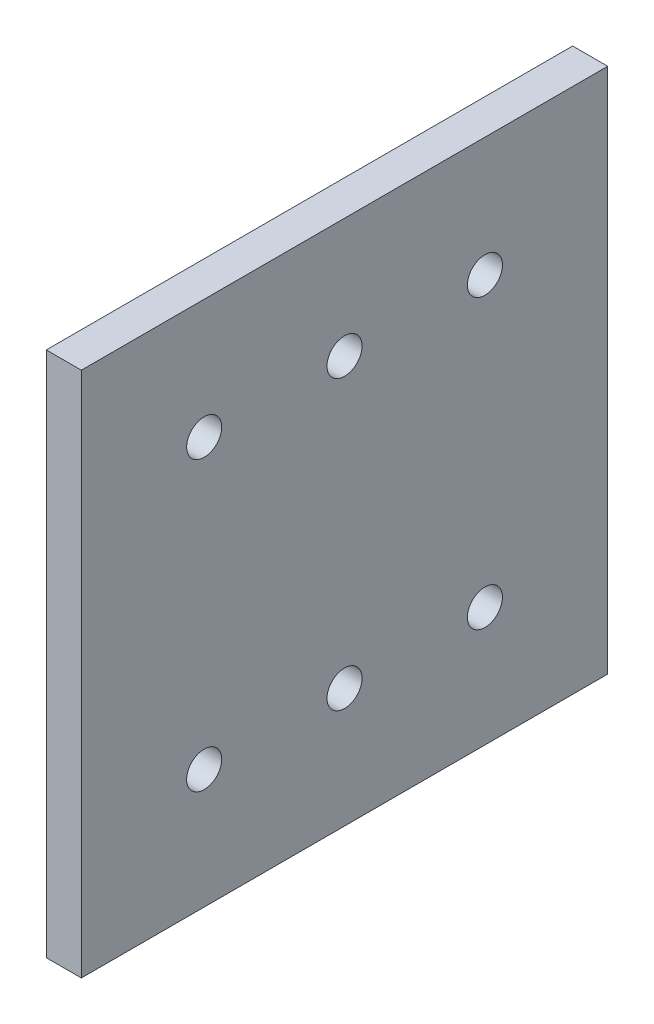
ISO-10303-21;
HEADER;
FILE_DESCRIPTION(('STEP AP214'),'2;1');
FILE_NAME('part.step','',(''),(''),'','','');
FILE_SCHEMA(('AUTOMOTIVE_DESIGN { 1 0 10303 214 1 1 1 1 }'));
ENDSEC;
DATA;
#1=APPLICATION_CONTEXT('core data for automotive mechanical design processes');
#2=APPLICATION_PROTOCOL_DEFINITION('international standard','automotive_design',2000,#1);
#3=PRODUCT_CONTEXT('',#1,'mechanical');
#4=PRODUCT('Part','Part','',(#3));
#5=PRODUCT_RELATED_PRODUCT_CATEGORY('part','',(#4));
#6=PRODUCT_DEFINITION_FORMATION('','',#4);
#7=PRODUCT_DEFINITION_CONTEXT('part definition',#1,'design');
#8=PRODUCT_DEFINITION('design','',#6,#7);
#9=PRODUCT_DEFINITION_SHAPE('','',#8);
#10=(LENGTH_UNIT() NAMED_UNIT(*) SI_UNIT(.MILLI.,.METRE.));
#11=(NAMED_UNIT(*) PLANE_ANGLE_UNIT() SI_UNIT($,.RADIAN.));
#12=(NAMED_UNIT(*) SI_UNIT($,.STERADIAN.) SOLID_ANGLE_UNIT());
#13=UNCERTAINTY_MEASURE_WITH_UNIT(LENGTH_MEASURE(1.E-05),#10,'distance_accuracy_value','');
#14=(GEOMETRIC_REPRESENTATION_CONTEXT(3) GLOBAL_UNCERTAINTY_ASSIGNED_CONTEXT((#13)) GLOBAL_UNIT_ASSIGNED_CONTEXT((#10,
#11,#12)) REPRESENTATION_CONTEXT('',''));
#15=CARTESIAN_POINT('',(0.,0.,0.));
#16=DIRECTION('',(0.,0.,1.));
#17=DIRECTION('',(1.,0.,0.));
#18=AXIS2_PLACEMENT_3D('',#15,#16,#17);
#19=CARTESIAN_POINT('',(418.,0.,0.));
#20=DIRECTION('',(-1.,0.,0.));
#21=DIRECTION('',(0.,0.,1.));
#22=AXIS2_PLACEMENT_3D('',#19,#20,#21);
#23=PLANE('',#22);
#24=DIRECTION('',(0.,-1.,0.));
#25=VECTOR('',#24,1.);
#26=CARTESIAN_POINT('',(418.,-20.5000000000011,1917.5));
#27=LINE('',#26,#25);
#28=CARTESIAN_POINT('',(418.,37.4999999999988,1917.5));
#29=VERTEX_POINT('',#28);
#30=CARTESIAN_POINT('',(418.,-37.500000000001,1917.5));
#31=VERTEX_POINT('',#30);
#32=EDGE_CURVE('E78',#29,#31,#27,.T.);
#33=ORIENTED_EDGE('',*,*,#32,.T.);
#34=DIRECTION('',(0.,0.,1.));
#35=VECTOR('',#34,1.);
#36=CARTESIAN_POINT('',(418.,-37.500000000001,1860.));
#37=LINE('',#36,#35);
#38=CARTESIAN_POINT('',(418.,-37.500000000001,1842.5));
#39=VERTEX_POINT('',#38);
#40=EDGE_CURVE('E85',#39,#31,#37,.T.);
#41=ORIENTED_EDGE('',*,*,#40,.F.);
#42=DIRECTION('',(0.,-1.,0.));
#43=VECTOR('',#42,1.);
#44=CARTESIAN_POINT('',(418.,-20.5000000000011,1842.5));
#45=LINE('',#44,#43);
#46=CARTESIAN_POINT('',(418.,37.4999999999988,1842.5));
#47=VERTEX_POINT('',#46);
#48=EDGE_CURVE('E93',#47,#39,#45,.T.);
#49=ORIENTED_EDGE('',*,*,#48,.F.);
#50=DIRECTION('',(0.,0.,1.));
#51=VECTOR('',#50,1.);
#52=CARTESIAN_POINT('',(418.,37.4999999999988,1860.));
#53=LINE('',#52,#51);
#54=EDGE_CURVE('E55',#47,#29,#53,.T.);
#55=ORIENTED_EDGE('',*,*,#54,.T.);
#56=EDGE_LOOP('',(#33,#41,#49,#55));
#57=FACE_BOUND('',#56,.T.);
#58=CARTESIAN_POINT('',(418.,-20.5000000000011,1900.));
#59=DIRECTION('',(1.,0.,0.));
#60=DIRECTION('',(0.,0.,-1.));
#61=AXIS2_PLACEMENT_3D('',#58,#59,#60);
#62=CIRCLE('',#61,2.49999999999999);
#63=CARTESIAN_POINT('',(418.,-20.5000000000011,1897.5));
#64=VERTEX_POINT('',#63);
#65=EDGE_CURVE('E104',#64,#64,#62,.T.);
#66=ORIENTED_EDGE('',*,*,#65,.F.);
#67=EDGE_LOOP('',(#66));
#68=FACE_BOUND('',#67,.T.);
#69=CARTESIAN_POINT('',(418.,-20.5000000000011,1860.));
#70=DIRECTION('',(1.,0.,0.));
#71=DIRECTION('',(0.,0.,-1.));
#72=AXIS2_PLACEMENT_3D('',#69,#70,#71);
#73=CIRCLE('',#72,2.49999999999999);
#74=CARTESIAN_POINT('',(418.,-20.5000000000011,1857.5));
#75=VERTEX_POINT('',#74);
#76=EDGE_CURVE('E151',#75,#75,#73,.T.);
#77=ORIENTED_EDGE('',*,*,#76,.F.);
#78=EDGE_LOOP('',(#77));
#79=FACE_BOUND('',#78,.T.);
#80=CARTESIAN_POINT('',(418.,20.4999999999988,1860.));
#81=DIRECTION('',(1.,0.,0.));
#82=DIRECTION('',(0.,0.,-1.));
#83=AXIS2_PLACEMENT_3D('',#80,#81,#82);
#84=CIRCLE('',#83,2.49999999999999);
#85=CARTESIAN_POINT('',(418.,20.4999999999988,1857.5));
#86=VERTEX_POINT('',#85);
#87=EDGE_CURVE('E146',#86,#86,#84,.T.);
#88=ORIENTED_EDGE('',*,*,#87,.F.);
#89=EDGE_LOOP('',(#88));
#90=FACE_BOUND('',#89,.T.);
#91=CARTESIAN_POINT('',(418.,20.4999999999988,1900.));
#92=DIRECTION('',(1.,0.,0.));
#93=DIRECTION('',(0.,0.,-1.));
#94=AXIS2_PLACEMENT_3D('',#91,#92,#93);
#95=CIRCLE('',#94,2.49999999999999);
#96=CARTESIAN_POINT('',(418.,20.4999999999988,1897.5));
#97=VERTEX_POINT('',#96);
#98=EDGE_CURVE('E141',#97,#97,#95,.T.);
#99=ORIENTED_EDGE('',*,*,#98,.F.);
#100=EDGE_LOOP('',(#99));
#101=FACE_BOUND('',#100,.T.);
#102=CARTESIAN_POINT('',(418.,-20.5000000000011,1880.));
#103=DIRECTION('',(1.,0.,0.));
#104=DIRECTION('',(0.,0.,-1.));
#105=AXIS2_PLACEMENT_3D('',#102,#103,#104);
#106=CIRCLE('',#105,2.49999999999999);
#107=CARTESIAN_POINT('',(418.,-20.5000000000011,1877.5));
#108=VERTEX_POINT('',#107);
#109=EDGE_CURVE('E136',#108,#108,#106,.T.);
#110=ORIENTED_EDGE('',*,*,#109,.F.);
#111=EDGE_LOOP('',(#110));
#112=FACE_BOUND('',#111,.T.);
#113=CARTESIAN_POINT('',(418.,20.4999999999988,1880.));
#114=DIRECTION('',(1.,0.,0.));
#115=DIRECTION('',(0.,0.,-1.));
#116=AXIS2_PLACEMENT_3D('',#113,#114,#115);
#117=CIRCLE('',#116,2.49999999999999);
#118=CARTESIAN_POINT('',(418.,20.4999999999988,1877.5));
#119=VERTEX_POINT('',#118);
#120=EDGE_CURVE('E130',#119,#119,#117,.T.);
#121=ORIENTED_EDGE('',*,*,#120,.F.);
#122=EDGE_LOOP('',(#121));
#123=FACE_BOUND('',#122,.T.);
#124=ADVANCED_FACE('F38',(#57,#68,#79,#90,#101,#112,#123),#23,.F.);
#125=CARTESIAN_POINT('',(413.,0.,0.));
#126=DIRECTION('',(-1.,0.,0.));
#127=DIRECTION('',(0.,0.,1.));
#128=AXIS2_PLACEMENT_3D('',#125,#126,#127);
#129=PLANE('',#128);
#130=CARTESIAN_POINT('',(413.,-20.5000000000011,1880.));
#131=DIRECTION('',(1.,0.,0.));
#132=DIRECTION('',(0.,0.,-1.));
#133=AXIS2_PLACEMENT_3D('',#130,#131,#132);
#134=CIRCLE('',#133,2.49999999999999);
#135=CARTESIAN_POINT('',(413.,-20.5000000000011,1877.5));
#136=VERTEX_POINT('',#135);
#137=EDGE_CURVE('E133',#136,#136,#134,.T.);
#138=ORIENTED_EDGE('',*,*,#137,.T.);
#139=EDGE_LOOP('',(#138));
#140=FACE_BOUND('',#139,.T.);
#141=CARTESIAN_POINT('',(413.,20.4999999999988,1860.));
#142=DIRECTION('',(1.,0.,0.));
#143=DIRECTION('',(0.,0.,-1.));
#144=AXIS2_PLACEMENT_3D('',#141,#142,#143);
#145=CIRCLE('',#144,2.49999999999999);
#146=CARTESIAN_POINT('',(413.,20.4999999999988,1857.5));
#147=VERTEX_POINT('',#146);
#148=EDGE_CURVE('E144',#147,#147,#145,.T.);
#149=ORIENTED_EDGE('',*,*,#148,.T.);
#150=EDGE_LOOP('',(#149));
#151=FACE_BOUND('',#150,.T.);
#152=CARTESIAN_POINT('',(413.,-20.5000000000011,1900.));
#153=DIRECTION('',(1.,0.,0.));
#154=DIRECTION('',(0.,0.,-1.));
#155=AXIS2_PLACEMENT_3D('',#152,#153,#154);
#156=CIRCLE('',#155,2.49999999999999);
#157=CARTESIAN_POINT('',(413.,-20.5000000000011,1897.5));
#158=VERTEX_POINT('',#157);
#159=EDGE_CURVE('E154',#158,#158,#156,.T.);
#160=ORIENTED_EDGE('',*,*,#159,.T.);
#161=EDGE_LOOP('',(#160));
#162=FACE_BOUND('',#161,.T.);
#163=DIRECTION('',(0.,-1.,0.));
#164=VECTOR('',#163,1.);
#165=CARTESIAN_POINT('',(413.,-20.5000000000011,1917.5));
#166=LINE('',#165,#164);
#167=CARTESIAN_POINT('',(413.,37.4999999999988,1917.5));
#168=VERTEX_POINT('',#167);
#169=CARTESIAN_POINT('',(413.,-37.500000000001,1917.5));
#170=VERTEX_POINT('',#169);
#171=EDGE_CURVE('E101',#168,#170,#166,.T.);
#172=ORIENTED_EDGE('',*,*,#171,.F.);
#173=DIRECTION('',(0.,0.,1.));
#174=VECTOR('',#173,1.);
#175=CARTESIAN_POINT('',(413.,37.4999999999988,1860.));
#176=LINE('',#175,#174);
#177=CARTESIAN_POINT('',(413.,37.4999999999988,1842.5));
#178=VERTEX_POINT('',#177);
#179=EDGE_CURVE('E73',#178,#168,#176,.T.);
#180=ORIENTED_EDGE('',*,*,#179,.F.);
#181=DIRECTION('',(0.,-1.,0.));
#182=VECTOR('',#181,1.);
#183=CARTESIAN_POINT('',(413.,-20.5000000000011,1842.5));
#184=LINE('',#183,#182);
#185=CARTESIAN_POINT('',(413.,-37.500000000001,1842.5));
#186=VERTEX_POINT('',#185);
#187=EDGE_CURVE('E106',#178,#186,#184,.T.);
#188=ORIENTED_EDGE('',*,*,#187,.T.);
#189=DIRECTION('',(0.,0.,1.));
#190=VECTOR('',#189,1.);
#191=CARTESIAN_POINT('',(413.,-37.500000000001,1860.));
#192=LINE('',#191,#190);
#193=EDGE_CURVE('E87',#186,#170,#192,.T.);
#194=ORIENTED_EDGE('',*,*,#193,.T.);
#195=EDGE_LOOP('',(#172,#180,#188,#194));
#196=FACE_BOUND('',#195,.T.);
#197=CARTESIAN_POINT('',(413.,-20.5000000000011,1860.));
#198=DIRECTION('',(1.,0.,0.));
#199=DIRECTION('',(0.,0.,-1.));
#200=AXIS2_PLACEMENT_3D('',#197,#198,#199);
#201=CIRCLE('',#200,2.49999999999999);
#202=CARTESIAN_POINT('',(413.,-20.5000000000011,1857.5));
#203=VERTEX_POINT('',#202);
#204=EDGE_CURVE('E121',#203,#203,#201,.T.);
#205=ORIENTED_EDGE('',*,*,#204,.T.);
#206=EDGE_LOOP('',(#205));
#207=FACE_BOUND('',#206,.T.);
#208=CARTESIAN_POINT('',(413.,20.4999999999988,1900.));
#209=DIRECTION('',(1.,0.,0.));
#210=DIRECTION('',(0.,0.,-1.));
#211=AXIS2_PLACEMENT_3D('',#208,#209,#210);
#212=CIRCLE('',#211,2.49999999999999);
#213=CARTESIAN_POINT('',(413.,20.4999999999988,1897.5));
#214=VERTEX_POINT('',#213);
#215=EDGE_CURVE('E125',#214,#214,#212,.T.);
#216=ORIENTED_EDGE('',*,*,#215,.T.);
#217=EDGE_LOOP('',(#216));
#218=FACE_BOUND('',#217,.T.);
#219=CARTESIAN_POINT('',(413.,20.4999999999988,1880.));
#220=DIRECTION('',(1.,0.,0.));
#221=DIRECTION('',(0.,0.,-1.));
#222=AXIS2_PLACEMENT_3D('',#219,#220,#221);
#223=CIRCLE('',#222,2.49999999999999);
#224=CARTESIAN_POINT('',(413.,20.4999999999988,1877.5));
#225=VERTEX_POINT('',#224);
#226=EDGE_CURVE('E128',#225,#225,#223,.T.);
#227=ORIENTED_EDGE('',*,*,#226,.T.);
#228=EDGE_LOOP('',(#227));
#229=FACE_BOUND('',#228,.T.);
#230=ADVANCED_FACE('F113',(#140,#151,#162,#196,#207,#218,#229),#129,.T.);
#231=CARTESIAN_POINT('',(418.,-20.5000000000011,1917.5));
#232=DIRECTION('',(0.,0.,-1.));
#233=DIRECTION('',(-1.,0.,0.));
#234=AXIS2_PLACEMENT_3D('',#231,#232,#233);
#235=PLANE('',#234);
#236=ORIENTED_EDGE('',*,*,#171,.T.);
#237=DIRECTION('',(-1.,0.,0.));
#238=VECTOR('',#237,1.);
#239=CARTESIAN_POINT('',(418.,-37.500000000001,1917.5));
#240=LINE('',#239,#238);
#241=EDGE_CURVE('E12',#31,#170,#240,.T.);
#242=ORIENTED_EDGE('',*,*,#241,.F.);
#243=ORIENTED_EDGE('',*,*,#32,.F.);
#244=DIRECTION('',(-1.,0.,0.));
#245=VECTOR('',#244,1.);
#246=CARTESIAN_POINT('',(418.,37.4999999999988,1917.5));
#247=LINE('',#246,#245);
#248=EDGE_CURVE('E97',#29,#168,#247,.T.);
#249=ORIENTED_EDGE('',*,*,#248,.T.);
#250=EDGE_LOOP('',(#236,#242,#243,#249));
#251=FACE_BOUND('',#250,.T.);
#252=ADVANCED_FACE('F40',(#251),#235,.F.);
#253=CARTESIAN_POINT('',(418.,-37.500000000001,1860.));
#254=DIRECTION('',(0.,-1.,0.));
#255=DIRECTION('',(1.,0.,0.));
#256=AXIS2_PLACEMENT_3D('',#253,#254,#255);
#257=PLANE('',#256);
#258=ORIENTED_EDGE('',*,*,#193,.F.);
#259=DIRECTION('',(-1.,0.,0.));
#260=VECTOR('',#259,1.);
#261=CARTESIAN_POINT('',(418.,-37.500000000001,1842.5));
#262=LINE('',#261,#260);
#263=EDGE_CURVE('E47',#39,#186,#262,.T.);
#264=ORIENTED_EDGE('',*,*,#263,.F.);
#265=ORIENTED_EDGE('',*,*,#40,.T.);
#266=ORIENTED_EDGE('',*,*,#241,.T.);
#267=EDGE_LOOP('',(#258,#264,#265,#266));
#268=FACE_BOUND('',#267,.T.);
#269=ADVANCED_FACE('F84',(#268),#257,.T.);
#270=CARTESIAN_POINT('',(418.,-20.5000000000011,1842.5));
#271=DIRECTION('',(0.,0.,-1.));
#272=DIRECTION('',(-1.,0.,0.));
#273=AXIS2_PLACEMENT_3D('',#270,#271,#272);
#274=PLANE('',#273);
#275=ORIENTED_EDGE('',*,*,#187,.F.);
#276=DIRECTION('',(-1.,0.,0.));
#277=VECTOR('',#276,1.);
#278=CARTESIAN_POINT('',(418.,37.4999999999988,1842.5));
#279=LINE('',#278,#277);
#280=EDGE_CURVE('E70',#47,#178,#279,.T.);
#281=ORIENTED_EDGE('',*,*,#280,.F.);
#282=ORIENTED_EDGE('',*,*,#48,.T.);
#283=ORIENTED_EDGE('',*,*,#263,.T.);
#284=EDGE_LOOP('',(#275,#281,#282,#283));
#285=FACE_BOUND('',#284,.T.);
#286=ADVANCED_FACE('F95',(#285),#274,.T.);
#287=CARTESIAN_POINT('',(418.,37.4999999999988,1860.));
#288=DIRECTION('',(0.,-1.,0.));
#289=DIRECTION('',(1.,0.,0.));
#290=AXIS2_PLACEMENT_3D('',#287,#288,#289);
#291=PLANE('',#290);
#292=ORIENTED_EDGE('',*,*,#179,.T.);
#293=ORIENTED_EDGE('',*,*,#248,.F.);
#294=ORIENTED_EDGE('',*,*,#54,.F.);
#295=ORIENTED_EDGE('',*,*,#280,.T.);
#296=EDGE_LOOP('',(#292,#293,#294,#295));
#297=FACE_BOUND('',#296,.T.);
#298=ADVANCED_FACE('F165',(#297),#291,.F.);
#299=CARTESIAN_POINT('',(418.,-20.5000000000011,1900.));
#300=DIRECTION('',(-1.,0.,0.));
#301=DIRECTION('',(0.,-1.,0.));
#302=AXIS2_PLACEMENT_3D('',#299,#300,#301);
#303=CYLINDRICAL_SURFACE('',#302,2.49999999999999);
#304=ORIENTED_EDGE('',*,*,#65,.T.);
#305=EDGE_LOOP('',(#304));
#306=FACE_BOUND('',#305,.T.);
#307=ORIENTED_EDGE('',*,*,#159,.F.);
#308=EDGE_LOOP('',(#307));
#309=FACE_BOUND('',#308,.T.);
#310=ADVANCED_FACE('F162',(#306,#309),#303,.F.);
#311=CARTESIAN_POINT('',(418.,-20.5000000000011,1860.));
#312=DIRECTION('',(-1.,0.,0.));
#313=DIRECTION('',(0.,-1.,0.));
#314=AXIS2_PLACEMENT_3D('',#311,#312,#313);
#315=CYLINDRICAL_SURFACE('',#314,2.49999999999999);
#316=ORIENTED_EDGE('',*,*,#76,.T.);
#317=EDGE_LOOP('',(#316));
#318=FACE_BOUND('',#317,.T.);
#319=ORIENTED_EDGE('',*,*,#204,.F.);
#320=EDGE_LOOP('',(#319));
#321=FACE_BOUND('',#320,.T.);
#322=ADVANCED_FACE('F164',(#318,#321),#315,.F.);
#323=CARTESIAN_POINT('',(418.,20.4999999999988,1860.));
#324=DIRECTION('',(-1.,0.,0.));
#325=DIRECTION('',(0.,-1.,0.));
#326=AXIS2_PLACEMENT_3D('',#323,#324,#325);
#327=CYLINDRICAL_SURFACE('',#326,2.49999999999999);
#328=ORIENTED_EDGE('',*,*,#87,.T.);
#329=EDGE_LOOP('',(#328));
#330=FACE_BOUND('',#329,.T.);
#331=ORIENTED_EDGE('',*,*,#148,.F.);
#332=EDGE_LOOP('',(#331));
#333=FACE_BOUND('',#332,.T.);
#334=ADVANCED_FACE('F173',(#330,#333),#327,.F.);
#335=CARTESIAN_POINT('',(418.,20.4999999999988,1900.));
#336=DIRECTION('',(-1.,0.,0.));
#337=DIRECTION('',(0.,-1.,0.));
#338=AXIS2_PLACEMENT_3D('',#335,#336,#337);
#339=CYLINDRICAL_SURFACE('',#338,2.49999999999999);
#340=ORIENTED_EDGE('',*,*,#98,.T.);
#341=EDGE_LOOP('',(#340));
#342=FACE_BOUND('',#341,.T.);
#343=ORIENTED_EDGE('',*,*,#215,.F.);
#344=EDGE_LOOP('',(#343));
#345=FACE_BOUND('',#344,.T.);
#346=ADVANCED_FACE('F264',(#342,#345),#339,.F.);
#347=CARTESIAN_POINT('',(418.,-20.5000000000011,1880.));
#348=DIRECTION('',(-1.,0.,0.));
#349=DIRECTION('',(0.,-1.,0.));
#350=AXIS2_PLACEMENT_3D('',#347,#348,#349);
#351=CYLINDRICAL_SURFACE('',#350,2.49999999999999);
#352=ORIENTED_EDGE('',*,*,#109,.T.);
#353=EDGE_LOOP('',(#352));
#354=FACE_BOUND('',#353,.T.);
#355=ORIENTED_EDGE('',*,*,#137,.F.);
#356=EDGE_LOOP('',(#355));
#357=FACE_BOUND('',#356,.T.);
#358=ADVANCED_FACE('F272',(#354,#357),#351,.F.);
#359=CARTESIAN_POINT('',(418.,20.4999999999988,1880.));
#360=DIRECTION('',(-1.,0.,0.));
#361=DIRECTION('',(0.,-1.,0.));
#362=AXIS2_PLACEMENT_3D('',#359,#360,#361);
#363=CYLINDRICAL_SURFACE('',#362,2.49999999999999);
#364=ORIENTED_EDGE('',*,*,#120,.T.);
#365=EDGE_LOOP('',(#364));
#366=FACE_BOUND('',#365,.T.);
#367=ORIENTED_EDGE('',*,*,#226,.F.);
#368=EDGE_LOOP('',(#367));
#369=FACE_BOUND('',#368,.T.);
#370=ADVANCED_FACE('F281',(#366,#369),#363,.F.);
#371=CLOSED_SHELL('',(#124,#230,#252,#269,#286,#298,#310,#322,#334,#346,#358,#370));
#372=MANIFOLD_SOLID_BREP('B2',#371);
#373=ADVANCED_BREP_SHAPE_REPRESENTATION('',(#18,#372),#14);
#374=SHAPE_DEFINITION_REPRESENTATION(#9,#373);
ENDSEC;
END-ISO-10303-21;
